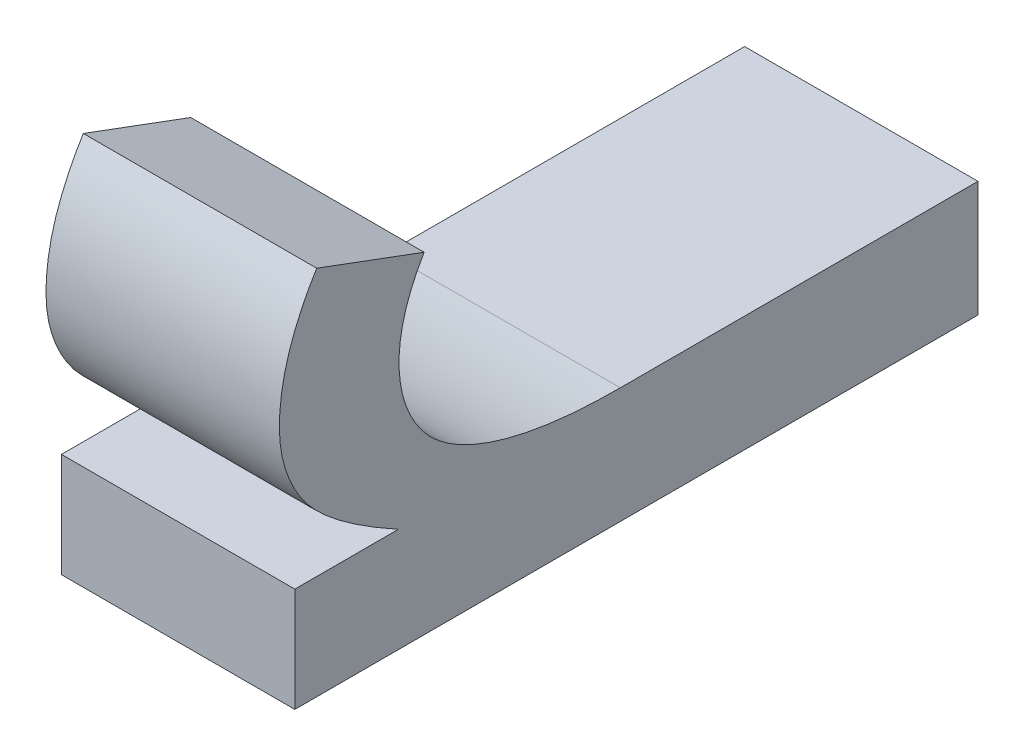
ISO-10303-21;
HEADER;
FILE_DESCRIPTION(('STEP AP214'),'2;1');
FILE_NAME('part.step','',(''),(''),'','','');
FILE_SCHEMA(('AUTOMOTIVE_DESIGN { 1 0 10303 214 1 1 1 1 }'));
ENDSEC;
DATA;
#1=APPLICATION_CONTEXT('core data for automotive mechanical design processes');
#2=APPLICATION_PROTOCOL_DEFINITION('international standard','automotive_design',2000,#1);
#3=PRODUCT_CONTEXT('',#1,'mechanical');
#4=PRODUCT('Part','Part','',(#3));
#5=PRODUCT_RELATED_PRODUCT_CATEGORY('part','',(#4));
#6=PRODUCT_DEFINITION_FORMATION('','',#4);
#7=PRODUCT_DEFINITION_CONTEXT('part definition',#1,'design');
#8=PRODUCT_DEFINITION('design','',#6,#7);
#9=PRODUCT_DEFINITION_SHAPE('','',#8);
#10=(LENGTH_UNIT() NAMED_UNIT(*) SI_UNIT(.MILLI.,.METRE.));
#11=(NAMED_UNIT(*) PLANE_ANGLE_UNIT() SI_UNIT($,.RADIAN.));
#12=(NAMED_UNIT(*) SI_UNIT($,.STERADIAN.) SOLID_ANGLE_UNIT());
#13=UNCERTAINTY_MEASURE_WITH_UNIT(LENGTH_MEASURE(1.E-05),#10,'distance_accuracy_value','');
#14=(GEOMETRIC_REPRESENTATION_CONTEXT(3) GLOBAL_UNCERTAINTY_ASSIGNED_CONTEXT((#13)) GLOBAL_UNIT_ASSIGNED_CONTEXT((#10,
#11,#12)) REPRESENTATION_CONTEXT('',''));
#15=CARTESIAN_POINT('',(0.,0.,0.));
#16=DIRECTION('',(0.,0.,1.));
#17=DIRECTION('',(1.,0.,0.));
#18=AXIS2_PLACEMENT_3D('',#15,#16,#17);
#19=CARTESIAN_POINT('',(4.55229940712876,-36.7510202825197,-8.87538537038163));
#20=DIRECTION('',(-1.,0.,0.));
#21=DIRECTION('',(0.,0.,1.));
#22=AXIS2_PLACEMENT_3D('',#19,#20,#21);
#23=PLANE('',#22);
#24=CARTESIAN_POINT('',(4.55229940712876,-36.6864828934484,-8.96380124884248));
#25=CARTESIAN_POINT('',(4.55229940712875,-36.6693923729041,-8.93265239688278));
#26=CARTESIAN_POINT('',(4.55229940712875,-36.6549205611529,-8.92272886882482));
#27=CARTESIAN_POINT('',(4.55229940712875,-36.6404487494017,-8.91280534076686));
#28=CARTESIAN_POINT('',(4.55229940712875,-36.6230825753003,-8.91280534076686));
#29=CARTESIAN_POINT('',(4.55229940712874,-36.5979981015982,-8.91280534076686));
#30=CARTESIAN_POINT('',(4.55229940712874,-36.5720866672247,-8.92879324708246));
#31=(BOUNDED_CURVE() B_SPLINE_CURVE(2,(#24,#25,#26,#27,#28,#29,#30),.UNSPECIFIED.,.F.,
.F.) B_SPLINE_CURVE_WITH_KNOTS((3,2,2,3),(11.6145194274029,12.6145194274029,13.6145194274029,
14.6145194274029),
.UNSPECIFIED.) CURVE() GEOMETRIC_REPRESENTATION_ITEM() RATIONAL_B_SPLINE_CURVE((1.,1.,1.,1.,1.,
1.,1.)) REPRESENTATION_ITEM(''));
#32=CARTESIAN_POINT('',(4.55229940712876,-36.6864828934484,-8.96380124884248));
#33=VERTEX_POINT('',#32);
#34=CARTESIAN_POINT('',(4.55229940712874,-36.5720866672247,-8.92879324708246));
#35=VERTEX_POINT('',#34);
#36=EDGE_CURVE('E124',#33,#35,#31,.T.);
#37=ORIENTED_EDGE('',*,*,#36,.T.);
#38=CARTESIAN_POINT('',(4.55229940712874,-36.5720866672247,-8.92879324708246));
#39=CARTESIAN_POINT('',(4.55229940712874,-36.5806319274968,-8.95181031910578));
#40=CARTESIAN_POINT('',(4.55229940712874,-36.5891771877689,-8.9748273911291));
#41=(BOUNDED_CURVE() B_SPLINE_CURVE(2,(#38,#39,#40),.UNSPECIFIED.,.F.,
.F.) B_SPLINE_CURVE_WITH_KNOTS((3,3),(14.6145194274029,15.6145194274029),
.UNSPECIFIED.) CURVE() GEOMETRIC_REPRESENTATION_ITEM() RATIONAL_B_SPLINE_CURVE((1.,1.,1.)) REPRESENTATION_ITEM(''));
#42=CARTESIAN_POINT('',(4.55229940712874,-36.5891771877689,-8.9748273911291));
#43=VERTEX_POINT('',#42);
#44=EDGE_CURVE('E192',#35,#43,#41,.T.);
#45=ORIENTED_EDGE('',*,*,#44,.T.);
#46=CARTESIAN_POINT('',(4.55229940712874,-36.5891771877689,-8.9748273911291));
#47=CARTESIAN_POINT('',(4.55229940712874,-36.6073703225419,-8.96407690239965));
#48=CARTESIAN_POINT('',(4.55229940712875,-36.6418270171875,-8.96407690239965));
#49=CARTESIAN_POINT('',(4.55229940712875,-36.6677384515611,-8.9836483049584));
#50=CARTESIAN_POINT('',(4.55229940712876,-36.6815211294194,-9.02747722054772));
#51=CARTESIAN_POINT('',(4.55229940712876,-36.6815211294194,-9.05890172606459));
#52=(BOUNDED_CURVE() B_SPLINE_CURVE(2,(#46,#47,#48,#49,#50,#51),.UNSPECIFIED.,.F.,
.F.) B_SPLINE_CURVE_WITH_KNOTS((3,1,1,1,3),(15.6145194274029,16.6145194274029,17.6145194274029,
18.6145194274029,19.6145194274029),
.UNSPECIFIED.) CURVE() GEOMETRIC_REPRESENTATION_ITEM() RATIONAL_B_SPLINE_CURVE((1.,1.,1.,1.,1.,1.)) REPRESENTATION_ITEM(''));
#53=CARTESIAN_POINT('',(4.55229940712876,-36.6815211294194,-9.05890172606459));
#54=VERTEX_POINT('',#53);
#55=EDGE_CURVE('E157',#43,#54,#52,.T.);
#56=ORIENTED_EDGE('',*,*,#55,.T.);
#57=CARTESIAN_POINT('',(4.55229940712876,-36.6815211294194,-9.05890172606459));
#58=CARTESIAN_POINT('',(4.55229940712876,-36.6815211294194,-9.13553341495661));
#59=CARTESIAN_POINT('',(4.55229940712876,-36.6815211294194,-9.21216510384864));
#60=(BOUNDED_CURVE() B_SPLINE_CURVE(2,(#57,#58,#59),.UNSPECIFIED.,.F.,
.F.) B_SPLINE_CURVE_WITH_KNOTS((3,3),(19.6145194274029,20.5620313565099),
.UNSPECIFIED.) CURVE() GEOMETRIC_REPRESENTATION_ITEM() RATIONAL_B_SPLINE_CURVE((1.,1.,1.)) REPRESENTATION_ITEM(''));
#61=CARTESIAN_POINT('',(4.55229940712876,-36.6815211294194,-9.21216510384864));
#62=VERTEX_POINT('',#61);
#63=EDGE_CURVE('E301',#54,#62,#60,.T.);
#64=ORIENTED_EDGE('',*,*,#63,.T.);
#65=CARTESIAN_POINT('',(4.55229940712876,-36.6815211294194,-9.21216510384864));
#66=CARTESIAN_POINT('',(4.55229940712876,-36.7063299495643,-9.21216510384864));
#67=CARTESIAN_POINT('',(4.55229940712877,-36.7311387697092,-9.21216510384864));
#68=(BOUNDED_CURVE() B_SPLINE_CURVE(2,(#65,#66,#67),.UNSPECIFIED.,.F.,
.F.) B_SPLINE_CURVE_WITH_KNOTS((3,3),(20.5620313565099,20.8687798227676),
.UNSPECIFIED.) CURVE() GEOMETRIC_REPRESENTATION_ITEM() RATIONAL_B_SPLINE_CURVE((1.,1.,1.)) REPRESENTATION_ITEM(''));
#69=CARTESIAN_POINT('',(4.55229940712877,-36.7311387697092,-9.21216510384864));
#70=VERTEX_POINT('',#69);
#71=EDGE_CURVE('E88',#62,#70,#68,.T.);
#72=ORIENTED_EDGE('',*,*,#71,.T.);
#73=CARTESIAN_POINT('',(4.55229940712877,-36.7311387697092,-9.21216510384864));
#74=CARTESIAN_POINT('',(4.55229940712876,-36.7311387697092,-9.06579306499374));
#75=CARTESIAN_POINT('',(4.55229940712876,-36.7311387697092,-8.91942102613884));
#76=(BOUNDED_CURVE() B_SPLINE_CURVE(2,(#73,#74,#75),.UNSPECIFIED.,.F.,
.F.) B_SPLINE_CURVE_WITH_KNOTS((3,3),(20.8687798227676,22.6785957736878),
.UNSPECIFIED.) CURVE() GEOMETRIC_REPRESENTATION_ITEM() RATIONAL_B_SPLINE_CURVE((1.,1.,1.)) REPRESENTATION_ITEM(''));
#77=CARTESIAN_POINT('',(4.55229940712876,-36.7311387697092,-8.91942102613884));
#78=VERTEX_POINT('',#77);
#79=EDGE_CURVE('E67',#70,#78,#76,.T.);
#80=ORIENTED_EDGE('',*,*,#79,.T.);
#81=CARTESIAN_POINT('',(4.55229940712876,-36.7311387697092,-8.91942102613884));
#82=CARTESIAN_POINT('',(4.55229940712876,-36.7088108315788,-8.91942102613883));
#83=CARTESIAN_POINT('',(4.55229940712876,-36.6864828934484,-8.91942102613883));
#84=(BOUNDED_CURVE() B_SPLINE_CURVE(2,(#81,#82,#83),.UNSPECIFIED.,.F.,
.F.) B_SPLINE_CURVE_WITH_KNOTS((3,3),(22.6785957736878,22.9546693933197),
.UNSPECIFIED.) CURVE() GEOMETRIC_REPRESENTATION_ITEM() RATIONAL_B_SPLINE_CURVE((1.,1.,1.)) REPRESENTATION_ITEM(''));
#85=CARTESIAN_POINT('',(4.55229940712876,-36.6864828934484,-8.91942102613883));
#86=VERTEX_POINT('',#85);
#87=EDGE_CURVE('E126',#78,#86,#84,.T.);
#88=ORIENTED_EDGE('',*,*,#87,.T.);
#89=CARTESIAN_POINT('',(4.55229940712876,-36.6864828934484,-8.91942102613883));
#90=CARTESIAN_POINT('',(4.55229940712876,-36.6864828934484,-8.94161113749066));
#91=CARTESIAN_POINT('',(4.55229940712876,-36.6864828934484,-8.96380124884248));
#92=(BOUNDED_CURVE() B_SPLINE_CURVE(2,(#89,#90,#91),.UNSPECIFIED.,.F.,
.F.) B_SPLINE_CURVE_WITH_KNOTS((3,3),(22.9546693933197,23.2290388548057),
.UNSPECIFIED.) CURVE() GEOMETRIC_REPRESENTATION_ITEM() RATIONAL_B_SPLINE_CURVE((1.,1.,1.)) REPRESENTATION_ITEM(''));
#93=EDGE_CURVE('E11',#86,#33,#92,.T.);
#94=ORIENTED_EDGE('',*,*,#93,.T.);
#95=EDGE_LOOP('',(#37,#45,#56,#64,#72,#80,#88,#94));
#96=FACE_BOUND('',#95,.T.);
#97=ADVANCED_FACE('F16',(#96),#23,.T.);
#98=CARTESIAN_POINT('',(4.65229940712876,-36.7510202825197,-8.87538537038163));
#99=DIRECTION('',(1.,0.,0.));
#100=DIRECTION('',(0.,1.,0.));
#101=AXIS2_PLACEMENT_3D('',#98,#99,#100);
#102=PLANE('',#101);
#103=CARTESIAN_POINT('',(4.65229940712876,-36.6864828934483,-8.91942102613883));
#104=CARTESIAN_POINT('',(4.65229940712876,-36.6864828934483,-8.94161113749066));
#105=CARTESIAN_POINT('',(4.65229940712876,-36.6864828934483,-8.96380124884249));
#106=(BOUNDED_CURVE() B_SPLINE_CURVE(2,(#103,#104,#105),.UNSPECIFIED.,.F.,
.F.) B_SPLINE_CURVE_WITH_KNOTS((3,3),(22.9546693933197,23.2290388548057),
.UNSPECIFIED.) CURVE() GEOMETRIC_REPRESENTATION_ITEM() RATIONAL_B_SPLINE_CURVE((1.,1.,1.)) REPRESENTATION_ITEM(''));
#107=CARTESIAN_POINT('',(4.65229940712876,-36.6864828934483,-8.91942102613883));
#108=VERTEX_POINT('',#107);
#109=CARTESIAN_POINT('',(4.65229940712876,-36.6864828934483,-8.96380124884249));
#110=VERTEX_POINT('',#109);
#111=EDGE_CURVE('E30',#108,#110,#106,.T.);
#112=ORIENTED_EDGE('',*,*,#111,.F.);
#113=CARTESIAN_POINT('',(4.65229940712876,-36.7311387697091,-8.91942102613884));
#114=CARTESIAN_POINT('',(4.65229940712876,-36.7088108315787,-8.91942102613884));
#115=CARTESIAN_POINT('',(4.65229940712876,-36.6864828934483,-8.91942102613883));
#116=(BOUNDED_CURVE() B_SPLINE_CURVE(2,(#113,#114,#115),.UNSPECIFIED.,.F.,
.F.) B_SPLINE_CURVE_WITH_KNOTS((3,3),(22.6785957736878,22.9546693933197),
.UNSPECIFIED.) CURVE() GEOMETRIC_REPRESENTATION_ITEM() RATIONAL_B_SPLINE_CURVE((1.,1.,1.)) REPRESENTATION_ITEM(''));
#117=CARTESIAN_POINT('',(4.65229940712876,-36.7311387697091,-8.91942102613884));
#118=VERTEX_POINT('',#117);
#119=EDGE_CURVE('E232',#118,#108,#116,.T.);
#120=ORIENTED_EDGE('',*,*,#119,.F.);
#121=CARTESIAN_POINT('',(4.65229940712877,-36.7311387697091,-9.21216510384864));
#122=CARTESIAN_POINT('',(4.65229940712876,-36.7311387697091,-9.06579306499374));
#123=CARTESIAN_POINT('',(4.65229940712876,-36.7311387697091,-8.91942102613884));
#124=(BOUNDED_CURVE() B_SPLINE_CURVE(2,(#121,#122,#123),.UNSPECIFIED.,.F.,
.F.) B_SPLINE_CURVE_WITH_KNOTS((3,3),(20.8687798227676,22.6785957736878),
.UNSPECIFIED.) CURVE() GEOMETRIC_REPRESENTATION_ITEM() RATIONAL_B_SPLINE_CURVE((1.,1.,1.)) REPRESENTATION_ITEM(''));
#125=CARTESIAN_POINT('',(4.65229940712877,-36.7311387697091,-9.21216510384864));
#126=VERTEX_POINT('',#125);
#127=EDGE_CURVE('E77',#126,#118,#124,.T.);
#128=ORIENTED_EDGE('',*,*,#127,.F.);
#129=CARTESIAN_POINT('',(4.65229940712876,-36.6815211294194,-9.21216510384864));
#130=CARTESIAN_POINT('',(4.65229940712876,-36.7063299495643,-9.21216510384864));
#131=CARTESIAN_POINT('',(4.65229940712877,-36.7311387697091,-9.21216510384864));
#132=(BOUNDED_CURVE() B_SPLINE_CURVE(2,(#129,#130,#131),.UNSPECIFIED.,.F.,
.F.) B_SPLINE_CURVE_WITH_KNOTS((3,3),(20.5620313565099,20.8687798227676),
.UNSPECIFIED.) CURVE() GEOMETRIC_REPRESENTATION_ITEM() RATIONAL_B_SPLINE_CURVE((1.,1.,1.)) REPRESENTATION_ITEM(''));
#133=CARTESIAN_POINT('',(4.65229940712876,-36.6815211294194,-9.21216510384864));
#134=VERTEX_POINT('',#133);
#135=EDGE_CURVE('E231',#134,#126,#132,.T.);
#136=ORIENTED_EDGE('',*,*,#135,.F.);
#137=CARTESIAN_POINT('',(4.65229940712876,-36.6815211294194,-9.05890172606459));
#138=CARTESIAN_POINT('',(4.65229940712876,-36.6815211294194,-9.13553341495661));
#139=CARTESIAN_POINT('',(4.65229940712876,-36.6815211294194,-9.21216510384864));
#140=(BOUNDED_CURVE() B_SPLINE_CURVE(2,(#137,#138,#139),.UNSPECIFIED.,.F.,
.F.) B_SPLINE_CURVE_WITH_KNOTS((3,3),(19.6145194274029,20.5620313565099),
.UNSPECIFIED.) CURVE() GEOMETRIC_REPRESENTATION_ITEM() RATIONAL_B_SPLINE_CURVE((1.,1.,1.)) REPRESENTATION_ITEM(''));
#141=CARTESIAN_POINT('',(4.65229940712876,-36.6815211294194,-9.05890172606459));
#142=VERTEX_POINT('',#141);
#143=EDGE_CURVE('E148',#142,#134,#140,.T.);
#144=ORIENTED_EDGE('',*,*,#143,.F.);
#145=CARTESIAN_POINT('',(4.65229940712874,-36.5891771877689,-8.97482739112911));
#146=CARTESIAN_POINT('',(4.65229940712875,-36.6073703225418,-8.96407690239965));
#147=CARTESIAN_POINT('',(4.65229940712875,-36.6418270171875,-8.96407690239965));
#148=CARTESIAN_POINT('',(4.65229940712875,-36.6677384515611,-8.9836483049584));
#149=CARTESIAN_POINT('',(4.65229940712876,-36.6815211294194,-9.02747722054772));
#150=CARTESIAN_POINT('',(4.65229940712876,-36.6815211294194,-9.05890172606459));
#151=(BOUNDED_CURVE() B_SPLINE_CURVE(2,(#145,#146,#147,#148,#149,#150),.UNSPECIFIED.,.F.,
.F.) B_SPLINE_CURVE_WITH_KNOTS((3,1,1,1,3),(15.6145194274029,16.6145194274029,17.6145194274029,
18.6145194274029,19.6145194274029),
.UNSPECIFIED.) CURVE() GEOMETRIC_REPRESENTATION_ITEM() RATIONAL_B_SPLINE_CURVE((1.,1.,1.,1.,1.,1.)) REPRESENTATION_ITEM(''));
#152=CARTESIAN_POINT('',(4.65229940712874,-36.5891771877689,-8.97482739112911));
#153=VERTEX_POINT('',#152);
#154=EDGE_CURVE('E183',#153,#142,#151,.T.);
#155=ORIENTED_EDGE('',*,*,#154,.F.);
#156=CARTESIAN_POINT('',(4.65229940712874,-36.5720866672246,-8.92879324708246));
#157=CARTESIAN_POINT('',(4.65229940712874,-36.5806319274968,-8.95181031910578));
#158=CARTESIAN_POINT('',(4.65229940712874,-36.5891771877689,-8.97482739112911));
#159=(BOUNDED_CURVE() B_SPLINE_CURVE(2,(#156,#157,#158),.UNSPECIFIED.,.F.,
.F.) B_SPLINE_CURVE_WITH_KNOTS((3,3),(14.6145194274029,15.6145194274029),
.UNSPECIFIED.) CURVE() GEOMETRIC_REPRESENTATION_ITEM() RATIONAL_B_SPLINE_CURVE((1.,1.,1.)) REPRESENTATION_ITEM(''));
#160=CARTESIAN_POINT('',(4.65229940712874,-36.5720866672246,-8.92879324708246));
#161=VERTEX_POINT('',#160);
#162=EDGE_CURVE('E133',#161,#153,#159,.T.);
#163=ORIENTED_EDGE('',*,*,#162,.F.);
#164=CARTESIAN_POINT('',(4.65229940712876,-36.6864828934483,-8.96380124884249));
#165=CARTESIAN_POINT('',(4.65229940712875,-36.6693923729041,-8.93265239688278));
#166=CARTESIAN_POINT('',(4.65229940712875,-36.6549205611529,-8.92272886882482));
#167=CARTESIAN_POINT('',(4.65229940712875,-36.6404487494017,-8.91280534076686));
#168=CARTESIAN_POINT('',(4.65229940712875,-36.6230825753003,-8.91280534076686));
#169=CARTESIAN_POINT('',(4.65229940712874,-36.5979981015982,-8.91280534076686));
#170=CARTESIAN_POINT('',(4.65229940712874,-36.5720866672246,-8.92879324708246));
#171=(BOUNDED_CURVE() B_SPLINE_CURVE(2,(#164,#165,#166,#167,#168,#169,#170),.UNSPECIFIED.,.F.,
.F.) B_SPLINE_CURVE_WITH_KNOTS((3,2,2,3),(11.6145194274029,12.6145194274029,13.6145194274029,
14.6145194274029),
.UNSPECIFIED.) CURVE() GEOMETRIC_REPRESENTATION_ITEM() RATIONAL_B_SPLINE_CURVE((1.,1.,1.,1.,1.,
1.,1.)) REPRESENTATION_ITEM(''));
#172=EDGE_CURVE('E141',#110,#161,#171,.T.);
#173=ORIENTED_EDGE('',*,*,#172,.F.);
#174=EDGE_LOOP('',(#112,#120,#128,#136,#144,#155,#163,#173));
#175=FACE_BOUND('',#174,.T.);
#176=ADVANCED_FACE('F314',(#175),#102,.T.);
#177=CARTESIAN_POINT('',(4.65229940712876,-36.6864828934483,-8.91942102613883));
#178=CARTESIAN_POINT('',(4.55229940712876,-36.6864828934484,-8.91942102613883));
#179=CARTESIAN_POINT('',(4.65229940712876,-36.6864828934483,-8.94161113749066));
#180=CARTESIAN_POINT('',(4.55229940712876,-36.6864828934484,-8.94161113749066));
#181=CARTESIAN_POINT('',(4.65229940712876,-36.6864828934483,-8.96380124884249));
#182=CARTESIAN_POINT('',(4.55229940712876,-36.6864828934484,-8.96380124884248));
#183=(BOUNDED_SURFACE() B_SPLINE_SURFACE(2,1,((#177,#178),(#179,#180),(#181,#182)),
.UNSPECIFIED.,.F.,.F.,.F.) B_SPLINE_SURFACE_WITH_KNOTS((3,3),(2,2),(22.9546693933197,
23.2290388548057),(0.,0.1),
.UNSPECIFIED.) GEOMETRIC_REPRESENTATION_ITEM() RATIONAL_B_SPLINE_SURFACE(((1.,1.),(1.,1.),(1.,1.))) REPRESENTATION_ITEM('') SURFACE());
#184=CARTESIAN_POINT('',(4.65229940712876,-36.6864828934483,-8.96380124884249));
#185=CARTESIAN_POINT('',(4.55229940712876,-36.6864828934484,-8.96380124884248));
#186=(BOUNDED_CURVE() B_SPLINE_CURVE(1,(#184,#185),.UNSPECIFIED.,.F.,
.F.) B_SPLINE_CURVE_WITH_KNOTS((2,2),(0.,0.1),
.UNSPECIFIED.) CURVE() GEOMETRIC_REPRESENTATION_ITEM() RATIONAL_B_SPLINE_CURVE((1.,1.)) REPRESENTATION_ITEM(''));
#187=EDGE_CURVE('E22',#110,#33,#186,.T.);
#188=CARTESIAN_POINT('',(4.65229940712876,-36.6864828934483,-8.91942102613883));
#189=CARTESIAN_POINT('',(4.55229940712876,-36.6864828934484,-8.91942102613883));
#190=(BOUNDED_CURVE() B_SPLINE_CURVE(1,(#188,#189),.UNSPECIFIED.,.F.,
.F.) B_SPLINE_CURVE_WITH_KNOTS((2,2),(0.,0.1),
.UNSPECIFIED.) CURVE() GEOMETRIC_REPRESENTATION_ITEM() RATIONAL_B_SPLINE_CURVE((1.,1.)) REPRESENTATION_ITEM(''));
#191=EDGE_CURVE('E182',#108,#86,#190,.T.);
#192=ORIENTED_EDGE('',*,*,#111,.T.);
#193=ORIENTED_EDGE('',*,*,#187,.T.);
#194=ORIENTED_EDGE('',*,*,#93,.F.);
#195=ORIENTED_EDGE('',*,*,#191,.F.);
#196=EDGE_LOOP('',(#192,#193,#194,#195));
#197=FACE_BOUND('',#196,.T.);
#198=ADVANCED_FACE('F129',(#197),#183,.T.);
#199=CARTESIAN_POINT('',(4.65229940712876,-36.7311387697091,-8.91942102613884));
#200=CARTESIAN_POINT('',(4.55229940712876,-36.7311387697092,-8.91942102613884));
#201=CARTESIAN_POINT('',(4.65229940712876,-36.7088108315787,-8.91942102613884));
#202=CARTESIAN_POINT('',(4.55229940712876,-36.7088108315788,-8.91942102613883));
#203=CARTESIAN_POINT('',(4.65229940712876,-36.6864828934483,-8.91942102613883));
#204=CARTESIAN_POINT('',(4.55229940712876,-36.6864828934484,-8.91942102613883));
#205=(BOUNDED_SURFACE() B_SPLINE_SURFACE(2,1,((#199,#200),(#201,#202),(#203,#204)),
.UNSPECIFIED.,.F.,.F.,.F.) B_SPLINE_SURFACE_WITH_KNOTS((3,3),(2,2),(22.6785957736878,
22.9546693933197),(0.,0.1),
.UNSPECIFIED.) GEOMETRIC_REPRESENTATION_ITEM() RATIONAL_B_SPLINE_SURFACE(((1.,1.),(1.,1.),(1.,1.))) REPRESENTATION_ITEM('') SURFACE());
#206=CARTESIAN_POINT('',(4.65229940712876,-36.7311387697091,-8.91942102613884));
#207=CARTESIAN_POINT('',(4.55229940712876,-36.7311387697092,-8.91942102613884));
#208=(BOUNDED_CURVE() B_SPLINE_CURVE(1,(#206,#207),.UNSPECIFIED.,.F.,
.F.) B_SPLINE_CURVE_WITH_KNOTS((2,2),(0.,0.1),
.UNSPECIFIED.) CURVE() GEOMETRIC_REPRESENTATION_ITEM() RATIONAL_B_SPLINE_CURVE((1.,1.)) REPRESENTATION_ITEM(''));
#209=EDGE_CURVE('E174',#118,#78,#208,.T.);
#210=ORIENTED_EDGE('',*,*,#119,.T.);
#211=ORIENTED_EDGE('',*,*,#191,.T.);
#212=ORIENTED_EDGE('',*,*,#87,.F.);
#213=ORIENTED_EDGE('',*,*,#209,.F.);
#214=EDGE_LOOP('',(#210,#211,#212,#213));
#215=FACE_BOUND('',#214,.T.);
#216=ADVANCED_FACE('F306',(#215),#205,.T.);
#217=CARTESIAN_POINT('',(4.65229940712877,-36.7311387697091,-9.21216510384864));
#218=CARTESIAN_POINT('',(4.55229940712877,-36.7311387697092,-9.21216510384864));
#219=CARTESIAN_POINT('',(4.65229940712876,-36.7311387697091,-9.06579306499374));
#220=CARTESIAN_POINT('',(4.55229940712876,-36.7311387697092,-9.06579306499374));
#221=CARTESIAN_POINT('',(4.65229940712876,-36.7311387697091,-8.91942102613884));
#222=CARTESIAN_POINT('',(4.55229940712876,-36.7311387697092,-8.91942102613884));
#223=(BOUNDED_SURFACE() B_SPLINE_SURFACE(2,1,((#217,#218),(#219,#220),(#221,#222)),
.UNSPECIFIED.,.F.,.F.,.F.) B_SPLINE_SURFACE_WITH_KNOTS((3,3),(2,2),(20.8687798227676,
22.6785957736878),(0.,0.1),
.UNSPECIFIED.) GEOMETRIC_REPRESENTATION_ITEM() RATIONAL_B_SPLINE_SURFACE(((1.,1.),(1.,1.),(1.,1.))) REPRESENTATION_ITEM('') SURFACE());
#224=CARTESIAN_POINT('',(4.65229940712877,-36.7311387697091,-9.21216510384864));
#225=CARTESIAN_POINT('',(4.55229940712877,-36.7311387697092,-9.21216510384864));
#226=(BOUNDED_CURVE() B_SPLINE_CURVE(1,(#224,#225),.UNSPECIFIED.,.F.,
.F.) B_SPLINE_CURVE_WITH_KNOTS((2,2),(0.,0.1),
.UNSPECIFIED.) CURVE() GEOMETRIC_REPRESENTATION_ITEM() RATIONAL_B_SPLINE_CURVE((1.,1.)) REPRESENTATION_ITEM(''));
#227=EDGE_CURVE('E224',#126,#70,#226,.T.);
#228=ORIENTED_EDGE('',*,*,#127,.T.);
#229=ORIENTED_EDGE('',*,*,#209,.T.);
#230=ORIENTED_EDGE('',*,*,#79,.F.);
#231=ORIENTED_EDGE('',*,*,#227,.F.);
#232=EDGE_LOOP('',(#228,#229,#230,#231));
#233=FACE_BOUND('',#232,.T.);
#234=ADVANCED_FACE('F305',(#233),#223,.T.);
#235=CARTESIAN_POINT('',(4.65229940712876,-36.6815211294194,-9.21216510384864));
#236=CARTESIAN_POINT('',(4.55229940712876,-36.6815211294194,-9.21216510384864));
#237=CARTESIAN_POINT('',(4.65229940712876,-36.7063299495643,-9.21216510384864));
#238=CARTESIAN_POINT('',(4.55229940712876,-36.7063299495643,-9.21216510384864));
#239=CARTESIAN_POINT('',(4.65229940712877,-36.7311387697091,-9.21216510384864));
#240=CARTESIAN_POINT('',(4.55229940712877,-36.7311387697092,-9.21216510384864));
#241=(BOUNDED_SURFACE() B_SPLINE_SURFACE(2,1,((#235,#236),(#237,#238),(#239,#240)),
.UNSPECIFIED.,.F.,.F.,.F.) B_SPLINE_SURFACE_WITH_KNOTS((3,3),(2,2),(20.5620313565099,
20.8687798227676),(0.,0.1),
.UNSPECIFIED.) GEOMETRIC_REPRESENTATION_ITEM() RATIONAL_B_SPLINE_SURFACE(((1.,1.),(1.,1.),(1.,1.))) REPRESENTATION_ITEM('') SURFACE());
#242=CARTESIAN_POINT('',(4.65229940712876,-36.6815211294194,-9.21216510384864));
#243=CARTESIAN_POINT('',(4.55229940712876,-36.6815211294194,-9.21216510384864));
#244=(BOUNDED_CURVE() B_SPLINE_CURVE(1,(#242,#243),.UNSPECIFIED.,.F.,
.F.) B_SPLINE_CURVE_WITH_KNOTS((2,2),(0.,0.1),
.UNSPECIFIED.) CURVE() GEOMETRIC_REPRESENTATION_ITEM() RATIONAL_B_SPLINE_CURVE((1.,1.)) REPRESENTATION_ITEM(''));
#245=EDGE_CURVE('E156',#134,#62,#244,.T.);
#246=ORIENTED_EDGE('',*,*,#135,.T.);
#247=ORIENTED_EDGE('',*,*,#227,.T.);
#248=ORIENTED_EDGE('',*,*,#71,.F.);
#249=ORIENTED_EDGE('',*,*,#245,.F.);
#250=EDGE_LOOP('',(#246,#247,#248,#249));
#251=FACE_BOUND('',#250,.T.);
#252=ADVANCED_FACE('F304',(#251),#241,.T.);
#253=CARTESIAN_POINT('',(4.65229940712876,-36.6815211294194,-9.05890172606459));
#254=CARTESIAN_POINT('',(4.55229940712876,-36.6815211294194,-9.05890172606459));
#255=CARTESIAN_POINT('',(4.65229940712876,-36.6815211294194,-9.13553341495661));
#256=CARTESIAN_POINT('',(4.55229940712876,-36.6815211294194,-9.13553341495661));
#257=CARTESIAN_POINT('',(4.65229940712876,-36.6815211294194,-9.21216510384864));
#258=CARTESIAN_POINT('',(4.55229940712876,-36.6815211294194,-9.21216510384864));
#259=(BOUNDED_SURFACE() B_SPLINE_SURFACE(2,1,((#253,#254),(#255,#256),(#257,#258)),
.UNSPECIFIED.,.F.,.F.,.F.) B_SPLINE_SURFACE_WITH_KNOTS((3,3),(2,2),(19.6145194274029,
20.5620313565099),(0.,0.1),
.UNSPECIFIED.) GEOMETRIC_REPRESENTATION_ITEM() RATIONAL_B_SPLINE_SURFACE(((1.,1.),(1.,1.),(1.,1.))) REPRESENTATION_ITEM('') SURFACE());
#260=CARTESIAN_POINT('',(4.65229940712876,-36.6815211294194,-9.05890172606459));
#261=CARTESIAN_POINT('',(4.55229940712876,-36.6815211294194,-9.05890172606459));
#262=(BOUNDED_CURVE() B_SPLINE_CURVE(1,(#260,#261),.UNSPECIFIED.,.F.,
.F.) B_SPLINE_CURVE_WITH_KNOTS((2,2),(0.,0.1),
.UNSPECIFIED.) CURVE() GEOMETRIC_REPRESENTATION_ITEM() RATIONAL_B_SPLINE_CURVE((1.,1.)) REPRESENTATION_ITEM(''));
#263=EDGE_CURVE('E166',#142,#54,#262,.T.);
#264=ORIENTED_EDGE('',*,*,#143,.T.);
#265=ORIENTED_EDGE('',*,*,#245,.T.);
#266=ORIENTED_EDGE('',*,*,#63,.F.);
#267=ORIENTED_EDGE('',*,*,#263,.F.);
#268=EDGE_LOOP('',(#264,#265,#266,#267));
#269=FACE_BOUND('',#268,.T.);
#270=ADVANCED_FACE('F365',(#269),#259,.T.);
#271=CARTESIAN_POINT('',(4.65229940712874,-36.5891771877689,-8.97482739112911));
#272=CARTESIAN_POINT('',(4.55229940712874,-36.5891771877689,-8.9748273911291));
#273=CARTESIAN_POINT('',(4.65229940712875,-36.6073703225418,-8.96407690239965));
#274=CARTESIAN_POINT('',(4.55229940712874,-36.6073703225419,-8.96407690239965));
#275=CARTESIAN_POINT('',(4.65229940712875,-36.6418270171875,-8.96407690239965));
#276=CARTESIAN_POINT('',(4.55229940712875,-36.6418270171875,-8.96407690239965));
#277=CARTESIAN_POINT('',(4.65229940712875,-36.6677384515611,-8.9836483049584));
#278=CARTESIAN_POINT('',(4.55229940712875,-36.6677384515611,-8.9836483049584));
#279=CARTESIAN_POINT('',(4.65229940712876,-36.6815211294194,-9.02747722054772));
#280=CARTESIAN_POINT('',(4.55229940712876,-36.6815211294194,-9.02747722054772));
#281=CARTESIAN_POINT('',(4.65229940712876,-36.6815211294194,-9.05890172606459));
#282=CARTESIAN_POINT('',(4.55229940712876,-36.6815211294194,-9.05890172606459));
#283=(BOUNDED_SURFACE() B_SPLINE_SURFACE(2,1,((#271,#272),(#273,#274),(#275,#276),(#277,#278),
(#279,#280),(#281,#282)),.UNSPECIFIED.,.F.,.F.,.F.) B_SPLINE_SURFACE_WITH_KNOTS((3,1,1,1,3),(2,
2),(15.6145194274029,16.6145194274029,17.6145194274029,18.6145194274029,19.6145194274029),(0.,
0.1),.UNSPECIFIED.) GEOMETRIC_REPRESENTATION_ITEM() RATIONAL_B_SPLINE_SURFACE(((1.,1.),(1.,1.),
(1.,1.),(1.,1.),(1.,1.),(1.,1.))) REPRESENTATION_ITEM('') SURFACE());
#284=CARTESIAN_POINT('',(4.65229940712874,-36.5891771877689,-8.97482739112911));
#285=CARTESIAN_POINT('',(4.55229940712874,-36.5891771877689,-8.9748273911291));
#286=(BOUNDED_CURVE() B_SPLINE_CURVE(1,(#284,#285),.UNSPECIFIED.,.F.,
.F.) B_SPLINE_CURVE_WITH_KNOTS((2,2),(0.,0.1),
.UNSPECIFIED.) CURVE() GEOMETRIC_REPRESENTATION_ITEM() RATIONAL_B_SPLINE_CURVE((1.,1.)) REPRESENTATION_ITEM(''));
#287=EDGE_CURVE('E209',#153,#43,#286,.T.);
#288=ORIENTED_EDGE('',*,*,#154,.T.);
#289=ORIENTED_EDGE('',*,*,#263,.T.);
#290=ORIENTED_EDGE('',*,*,#55,.F.);
#291=ORIENTED_EDGE('',*,*,#287,.F.);
#292=EDGE_LOOP('',(#288,#289,#290,#291));
#293=FACE_BOUND('',#292,.T.);
#294=ADVANCED_FACE('F374',(#293),#283,.T.);
#295=CARTESIAN_POINT('',(4.65229940712874,-36.5720866672246,-8.92879324708246));
#296=CARTESIAN_POINT('',(4.55229940712874,-36.5720866672247,-8.92879324708246));
#297=CARTESIAN_POINT('',(4.65229940712874,-36.5806319274968,-8.95181031910578));
#298=CARTESIAN_POINT('',(4.55229940712874,-36.5806319274968,-8.95181031910578));
#299=CARTESIAN_POINT('',(4.65229940712874,-36.5891771877689,-8.97482739112911));
#300=CARTESIAN_POINT('',(4.55229940712874,-36.5891771877689,-8.9748273911291));
#301=(BOUNDED_SURFACE() B_SPLINE_SURFACE(2,1,((#295,#296),(#297,#298),(#299,#300)),
.UNSPECIFIED.,.F.,.F.,.F.) B_SPLINE_SURFACE_WITH_KNOTS((3,3),(2,2),(14.6145194274029,
15.6145194274029),(0.,0.1),
.UNSPECIFIED.) GEOMETRIC_REPRESENTATION_ITEM() RATIONAL_B_SPLINE_SURFACE(((1.,1.),(1.,1.),(1.,1.))) REPRESENTATION_ITEM('') SURFACE());
#302=CARTESIAN_POINT('',(4.65229940712874,-36.5720866672246,-8.92879324708246));
#303=CARTESIAN_POINT('',(4.55229940712874,-36.5720866672247,-8.92879324708246));
#304=(BOUNDED_CURVE() B_SPLINE_CURVE(1,(#302,#303),.UNSPECIFIED.,.F.,
.F.) B_SPLINE_CURVE_WITH_KNOTS((2,2),(0.,0.1),
.UNSPECIFIED.) CURVE() GEOMETRIC_REPRESENTATION_ITEM() RATIONAL_B_SPLINE_CURVE((1.,1.)) REPRESENTATION_ITEM(''));
#305=EDGE_CURVE('E135',#161,#35,#304,.T.);
#306=ORIENTED_EDGE('',*,*,#162,.T.);
#307=ORIENTED_EDGE('',*,*,#287,.T.);
#308=ORIENTED_EDGE('',*,*,#44,.F.);
#309=ORIENTED_EDGE('',*,*,#305,.F.);
#310=EDGE_LOOP('',(#306,#307,#308,#309));
#311=FACE_BOUND('',#310,.T.);
#312=ADVANCED_FACE('F385',(#311),#301,.T.);
#313=CARTESIAN_POINT('',(4.65229940712876,-36.6864828934483,-8.96380124884249));
#314=CARTESIAN_POINT('',(4.55229940712876,-36.6864828934484,-8.96380124884248));
#315=CARTESIAN_POINT('',(4.65229940712875,-36.6693923729041,-8.93265239688278));
#316=CARTESIAN_POINT('',(4.55229940712875,-36.6693923729041,-8.93265239688278));
#317=CARTESIAN_POINT('',(4.65229940712875,-36.6549205611529,-8.92272886882482));
#318=CARTESIAN_POINT('',(4.55229940712875,-36.6549205611529,-8.92272886882482));
#319=CARTESIAN_POINT('',(4.65229940712875,-36.6404487494017,-8.91280534076686));
#320=CARTESIAN_POINT('',(4.55229940712875,-36.6404487494017,-8.91280534076686));
#321=CARTESIAN_POINT('',(4.65229940712875,-36.6230825753003,-8.91280534076686));
#322=CARTESIAN_POINT('',(4.55229940712875,-36.6230825753003,-8.91280534076686));
#323=CARTESIAN_POINT('',(4.65229940712874,-36.5979981015982,-8.91280534076686));
#324=CARTESIAN_POINT('',(4.55229940712874,-36.5979981015982,-8.91280534076686));
#325=CARTESIAN_POINT('',(4.65229940712874,-36.5720866672246,-8.92879324708246));
#326=CARTESIAN_POINT('',(4.55229940712874,-36.5720866672247,-8.92879324708246));
#327=(BOUNDED_SURFACE() B_SPLINE_SURFACE(2,1,((#313,#314),(#315,#316),(#317,#318),(#319,#320),
(#321,#322),(#323,#324),(#325,#326)),.UNSPECIFIED.,.F.,.F.,.F.) B_SPLINE_SURFACE_WITH_KNOTS((3,
2,2,3),(2,2),(11.6145194274029,12.6145194274029,13.6145194274029,14.6145194274029),(0.,0.1),
.UNSPECIFIED.) GEOMETRIC_REPRESENTATION_ITEM() RATIONAL_B_SPLINE_SURFACE(((1.,1.),(1.,1.),(1.,
1.),(1.,1.),(1.,1.),(1.,1.),(1.,1.))) REPRESENTATION_ITEM('') SURFACE());
#328=ORIENTED_EDGE('',*,*,#172,.T.);
#329=ORIENTED_EDGE('',*,*,#305,.T.);
#330=ORIENTED_EDGE('',*,*,#36,.F.);
#331=ORIENTED_EDGE('',*,*,#187,.F.);
#332=EDGE_LOOP('',(#328,#329,#330,#331));
#333=FACE_BOUND('',#332,.T.);
#334=ADVANCED_FACE('F18',(#333),#327,.T.);
#335=CLOSED_SHELL('',(#97,#176,#198,#216,#234,#252,#270,#294,#312,#334));
#336=MANIFOLD_SOLID_BREP('B1',#335);
#337=ADVANCED_BREP_SHAPE_REPRESENTATION('',(#18,#336),#14);
#338=SHAPE_DEFINITION_REPRESENTATION(#9,#337);
ENDSEC;
END-ISO-10303-21;
